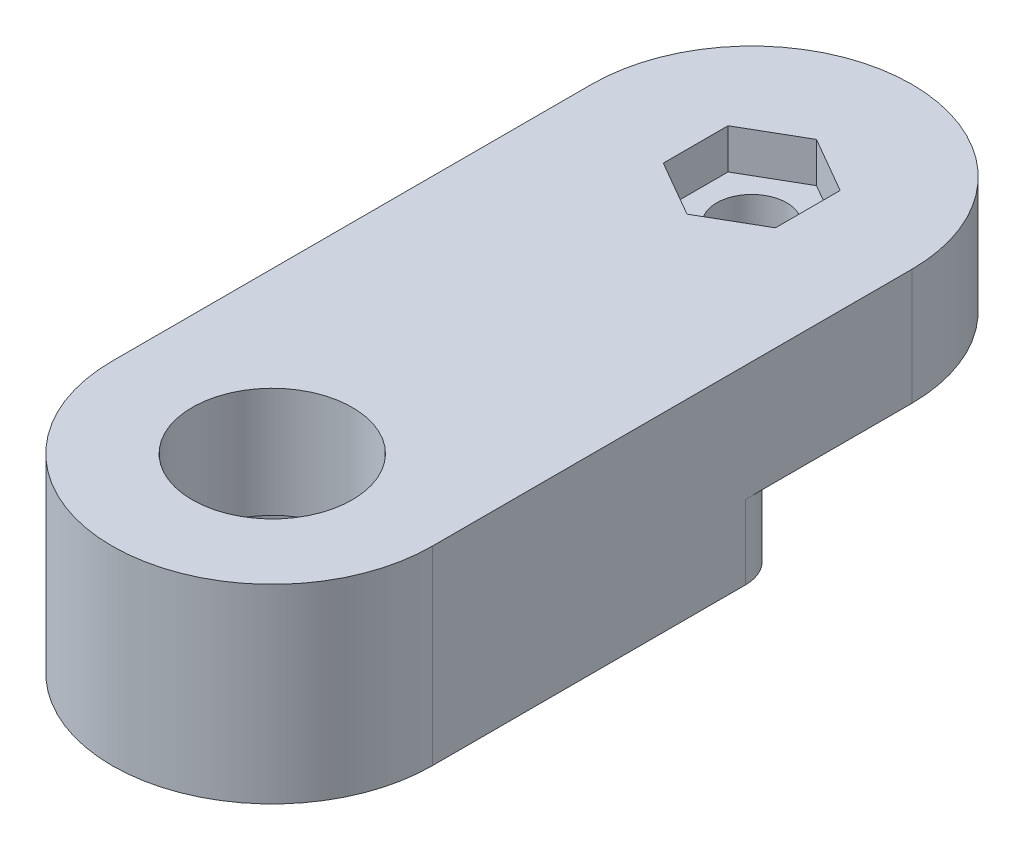
ISO-10303-21;
HEADER;
FILE_DESCRIPTION(('STEP AP214'),'2;1');
FILE_NAME('part.step','',(''),(''),'','','');
FILE_SCHEMA(('AUTOMOTIVE_DESIGN { 1 0 10303 214 1 1 1 1 }'));
ENDSEC;
DATA;
#1=APPLICATION_CONTEXT('core data for automotive mechanical design processes');
#2=APPLICATION_PROTOCOL_DEFINITION('international standard','automotive_design',2000,#1);
#3=PRODUCT_CONTEXT('',#1,'mechanical');
#4=PRODUCT('Part','Part','',(#3));
#5=PRODUCT_RELATED_PRODUCT_CATEGORY('part','',(#4));
#6=PRODUCT_DEFINITION_FORMATION('','',#4);
#7=PRODUCT_DEFINITION_CONTEXT('part definition',#1,'design');
#8=PRODUCT_DEFINITION('design','',#6,#7);
#9=PRODUCT_DEFINITION_SHAPE('','',#8);
#10=(LENGTH_UNIT() NAMED_UNIT(*) SI_UNIT(.MILLI.,.METRE.));
#11=(NAMED_UNIT(*) PLANE_ANGLE_UNIT() SI_UNIT($,.RADIAN.));
#12=(NAMED_UNIT(*) SI_UNIT($,.STERADIAN.) SOLID_ANGLE_UNIT());
#13=UNCERTAINTY_MEASURE_WITH_UNIT(LENGTH_MEASURE(1.E-05),#10,'distance_accuracy_value','');
#14=(GEOMETRIC_REPRESENTATION_CONTEXT(3) GLOBAL_UNCERTAINTY_ASSIGNED_CONTEXT((#13)) GLOBAL_UNIT_ASSIGNED_CONTEXT((#10,
#11,#12)) REPRESENTATION_CONTEXT('',''));
#15=CARTESIAN_POINT('',(0.,0.,0.));
#16=DIRECTION('',(0.,0.,1.));
#17=DIRECTION('',(1.,0.,0.));
#18=AXIS2_PLACEMENT_3D('',#15,#16,#17);
#19=CARTESIAN_POINT('',(0.,9.50100000000002,-23.95));
#20=DIRECTION('',(0.,-1.,0.));
#21=DIRECTION('',(0.,0.,-1.));
#22=AXIS2_PLACEMENT_3D('',#19,#20,#21);
#23=CYLINDRICAL_SURFACE('',#22,1.75);
#24=CARTESIAN_POINT('',(0.,3.5,-23.95));
#25=DIRECTION('',(0.,-1.,0.));
#26=DIRECTION('',(0.,0.,-1.));
#27=AXIS2_PLACEMENT_3D('',#24,#25,#26);
#28=CIRCLE('',#27,1.75);
#29=CARTESIAN_POINT('',(0.,3.5,-25.7));
#30=VERTEX_POINT('',#29);
#31=EDGE_CURVE('E196',#30,#30,#28,.T.);
#32=ORIENTED_EDGE('',*,*,#31,.T.);
#33=EDGE_LOOP('',(#32));
#34=FACE_BOUND('',#33,.T.);
#35=CARTESIAN_POINT('',(0.,7.5,-23.95));
#36=DIRECTION('',(0.,1.,0.));
#37=DIRECTION('',(0.,0.,1.));
#38=AXIS2_PLACEMENT_3D('',#35,#36,#37);
#39=CIRCLE('',#38,1.75);
#40=CARTESIAN_POINT('',(0.,7.5,-22.2));
#41=VERTEX_POINT('',#40);
#42=EDGE_CURVE('E188',#41,#41,#39,.F.);
#43=ORIENTED_EDGE('',*,*,#42,.F.);
#44=EDGE_LOOP('',(#43));
#45=FACE_BOUND('',#44,.T.);
#46=ADVANCED_FACE('F37',(#34,#45),#23,.F.);
#47=CARTESIAN_POINT('',(0.,3.7,0.));
#48=DIRECTION('',(0.,1.,0.));
#49=DIRECTION('',(0.,0.,1.));
#50=AXIS2_PLACEMENT_3D('',#47,#48,#49);
#51=PLANE('',#50);
#52=DIRECTION('',(0.,0.,-1.));
#53=VECTOR('',#52,1.);
#54=CARTESIAN_POINT('',(-8.,3.7,0.));
#55=LINE('',#54,#53);
#56=CARTESIAN_POINT('',(-8.,3.7,-15.6396149307027));
#57=VERTEX_POINT('',#56);
#58=CARTESIAN_POINT('',(-8.,3.7,-23.95));
#59=VERTEX_POINT('',#58);
#60=EDGE_CURVE('E205',#57,#59,#55,.T.);
#61=ORIENTED_EDGE('',*,*,#60,.T.);
#62=CARTESIAN_POINT('',(0.,3.7,-23.95));
#63=DIRECTION('',(0.,1.,0.));
#64=DIRECTION('',(0.,0.,1.));
#65=AXIS2_PLACEMENT_3D('',#62,#63,#64);
#66=CIRCLE('',#65,8.);
#67=CARTESIAN_POINT('',(8.,3.7,-23.95));
#68=VERTEX_POINT('',#67);
#69=EDGE_CURVE('E253',#68,#59,#66,.T.);
#70=ORIENTED_EDGE('',*,*,#69,.F.);
#71=DIRECTION('',(0.,0.,-1.));
#72=VECTOR('',#71,1.);
#73=CARTESIAN_POINT('',(8.,3.7,0.));
#74=LINE('',#73,#72);
#75=CARTESIAN_POINT('',(8.,3.7,-15.6396149307027));
#76=VERTEX_POINT('',#75);
#77=EDGE_CURVE('E51',#76,#68,#74,.T.);
#78=ORIENTED_EDGE('',*,*,#77,.F.);
#79=CARTESIAN_POINT('',(6.,3.7,-15.6396149307027));
#80=DIRECTION('',(0.,1.,0.));
#81=DIRECTION('',(0.,0.,1.));
#82=AXIS2_PLACEMENT_3D('',#79,#80,#81);
#83=CIRCLE('',#82,2.);
#84=CARTESIAN_POINT('',(4.82926829268293,3.7,-17.2611534808095));
#85=VERTEX_POINT('',#84);
#86=EDGE_CURVE('E12',#76,#85,#83,.T.);
#87=ORIENTED_EDGE('',*,*,#86,.T.);
#88=CARTESIAN_POINT('',(0.,3.7,-23.95));
#89=DIRECTION('',(0.,1.,0.));
#90=DIRECTION('',(0.,0.,1.));
#91=AXIS2_PLACEMENT_3D('',#88,#89,#90);
#92=CIRCLE('',#91,8.25);
#93=CARTESIAN_POINT('',(-4.82926829268293,3.7,-17.2611534808095));
#94=VERTEX_POINT('',#93);
#95=EDGE_CURVE('E202',#94,#85,#92,.T.);
#96=ORIENTED_EDGE('',*,*,#95,.F.);
#97=CARTESIAN_POINT('',(-6.,3.7,-15.6396149307027));
#98=DIRECTION('',(0.,1.,0.));
#99=DIRECTION('',(0.,0.,1.));
#100=AXIS2_PLACEMENT_3D('',#97,#98,#99);
#101=CIRCLE('',#100,2.);
#102=EDGE_CURVE('E45',#94,#57,#101,.T.);
#103=ORIENTED_EDGE('',*,*,#102,.T.);
#104=EDGE_LOOP('',(#61,#70,#78,#87,#96,#103));
#105=FACE_BOUND('',#104,.T.);
#106=CARTESIAN_POINT('',(0.,3.7,-23.95));
#107=DIRECTION('',(0.,1.,0.));
#108=DIRECTION('',(0.,0.,1.));
#109=AXIS2_PLACEMENT_3D('',#106,#107,#108);
#110=CIRCLE('',#109,4.1);
#111=CARTESIAN_POINT('',(0.,3.7,-19.85));
#112=VERTEX_POINT('',#111);
#113=EDGE_CURVE('E256',#112,#112,#110,.F.);
#114=ORIENTED_EDGE('',*,*,#113,.F.);
#115=EDGE_LOOP('',(#114));
#116=FACE_BOUND('',#115,.T.);
#117=ADVANCED_FACE('F277',(#105,#116),#51,.F.);
#118=CARTESIAN_POINT('',(-8.,4.,0.));
#119=DIRECTION('',(-1.,0.,0.));
#120=DIRECTION('',(0.,0.,1.));
#121=AXIS2_PLACEMENT_3D('',#118,#119,#120);
#122=PLANE('',#121);
#123=ORIENTED_EDGE('',*,*,#60,.F.);
#124=DIRECTION('',(0.,-1.,0.));
#125=VECTOR('',#124,1.);
#126=CARTESIAN_POINT('',(-8.,4.,-15.6396149307027));
#127=LINE('',#126,#125);
#128=CARTESIAN_POINT('',(-8.,0.,-15.6396149307027));
#129=VERTEX_POINT('',#128);
#130=EDGE_CURVE('E259',#57,#129,#127,.T.);
#131=ORIENTED_EDGE('',*,*,#130,.T.);
#132=DIRECTION('',(0.,0.,-1.));
#133=VECTOR('',#132,1.);
#134=CARTESIAN_POINT('',(-8.,0.,0.));
#135=LINE('',#134,#133);
#136=CARTESIAN_POINT('',(-8.,0.,0.));
#137=VERTEX_POINT('',#136);
#138=EDGE_CURVE('E228',#137,#129,#135,.T.);
#139=ORIENTED_EDGE('',*,*,#138,.F.);
#140=DIRECTION('',(0.,-1.,0.));
#141=VECTOR('',#140,1.);
#142=CARTESIAN_POINT('',(-8.,4.,0.));
#143=LINE('',#142,#141);
#144=CARTESIAN_POINT('',(-8.,9.50000000000002,0.));
#145=VERTEX_POINT('',#144);
#146=EDGE_CURVE('E248',#145,#137,#143,.T.);
#147=ORIENTED_EDGE('',*,*,#146,.F.);
#148=DIRECTION('',(0.,0.,1.));
#149=VECTOR('',#148,1.);
#150=CARTESIAN_POINT('',(-8.,9.5,-23.95));
#151=LINE('',#150,#149);
#152=CARTESIAN_POINT('',(-8.,9.50000000000002,-23.95));
#153=VERTEX_POINT('',#152);
#154=EDGE_CURVE('E214',#153,#145,#151,.T.);
#155=ORIENTED_EDGE('',*,*,#154,.F.);
#156=DIRECTION('',(0.,-1.,0.));
#157=VECTOR('',#156,1.);
#158=CARTESIAN_POINT('',(-8.,4.,-23.95));
#159=LINE('',#158,#157);
#160=EDGE_CURVE('E239',#153,#59,#159,.T.);
#161=ORIENTED_EDGE('',*,*,#160,.T.);
#162=EDGE_LOOP('',(#123,#131,#139,#147,#155,#161));
#163=FACE_BOUND('',#162,.T.);
#164=ADVANCED_FACE('F284',(#163),#122,.T.);
#165=CARTESIAN_POINT('',(8.,4.,0.));
#166=DIRECTION('',(-1.,0.,0.));
#167=DIRECTION('',(0.,0.,1.));
#168=AXIS2_PLACEMENT_3D('',#165,#166,#167);
#169=PLANE('',#168);
#170=DIRECTION('',(0.,0.,-1.));
#171=VECTOR('',#170,1.);
#172=CARTESIAN_POINT('',(8.,0.,0.));
#173=LINE('',#172,#171);
#174=CARTESIAN_POINT('',(8.,0.,0.));
#175=VERTEX_POINT('',#174);
#176=CARTESIAN_POINT('',(8.,0.,-15.6396149307027));
#177=VERTEX_POINT('',#176);
#178=EDGE_CURVE('E233',#175,#177,#173,.T.);
#179=ORIENTED_EDGE('',*,*,#178,.T.);
#180=DIRECTION('',(0.,1.,0.));
#181=VECTOR('',#180,1.);
#182=CARTESIAN_POINT('',(8.,3.7,-15.6396149307027));
#183=LINE('',#182,#181);
#184=EDGE_CURVE('E273',#177,#76,#183,.T.);
#185=ORIENTED_EDGE('',*,*,#184,.T.);
#186=ORIENTED_EDGE('',*,*,#77,.T.);
#187=DIRECTION('',(0.,-1.,0.));
#188=VECTOR('',#187,1.);
#189=CARTESIAN_POINT('',(8.,4.,-23.95));
#190=LINE('',#189,#188);
#191=CARTESIAN_POINT('',(8.,9.5,-23.95));
#192=VERTEX_POINT('',#191);
#193=EDGE_CURVE('E242',#192,#68,#190,.T.);
#194=ORIENTED_EDGE('',*,*,#193,.F.);
#195=DIRECTION('',(0.,0.,-1.));
#196=VECTOR('',#195,1.);
#197=CARTESIAN_POINT('',(8.,9.5,0.));
#198=LINE('',#197,#196);
#199=CARTESIAN_POINT('',(8.,9.50000000000002,0.));
#200=VERTEX_POINT('',#199);
#201=EDGE_CURVE('E208',#200,#192,#198,.T.);
#202=ORIENTED_EDGE('',*,*,#201,.F.);
#203=DIRECTION('',(0.,-1.,0.));
#204=VECTOR('',#203,1.);
#205=CARTESIAN_POINT('',(8.,4.,0.));
#206=LINE('',#205,#204);
#207=EDGE_CURVE('E245',#200,#175,#206,.T.);
#208=ORIENTED_EDGE('',*,*,#207,.T.);
#209=EDGE_LOOP('',(#179,#185,#186,#194,#202,#208));
#210=FACE_BOUND('',#209,.T.);
#211=ADVANCED_FACE('F296',(#210),#169,.F.);
#212=CARTESIAN_POINT('',(0.,4.,0.));
#213=DIRECTION('',(0.,-1.,0.));
#214=DIRECTION('',(0.,0.,-1.));
#215=AXIS2_PLACEMENT_3D('',#212,#213,#214);
#216=CYLINDRICAL_SURFACE('',#215,8.);
#217=CARTESIAN_POINT('',(0.,0.,0.));
#218=DIRECTION('',(0.,1.,0.));
#219=DIRECTION('',(0.,0.,1.));
#220=AXIS2_PLACEMENT_3D('',#217,#218,#219);
#221=CIRCLE('',#220,8.);
#222=EDGE_CURVE('E231',#137,#175,#221,.T.);
#223=ORIENTED_EDGE('',*,*,#222,.T.);
#224=ORIENTED_EDGE('',*,*,#207,.F.);
#225=CARTESIAN_POINT('',(0.,9.5,0.));
#226=DIRECTION('',(0.,1.,0.));
#227=DIRECTION('',(0.,0.,1.));
#228=AXIS2_PLACEMENT_3D('',#225,#226,#227);
#229=CIRCLE('',#228,8.);
#230=EDGE_CURVE('E211',#145,#200,#229,.T.);
#231=ORIENTED_EDGE('',*,*,#230,.F.);
#232=ORIENTED_EDGE('',*,*,#146,.T.);
#233=EDGE_LOOP('',(#223,#224,#231,#232));
#234=FACE_BOUND('',#233,.T.);
#235=ADVANCED_FACE('F292',(#234),#216,.T.);
#236=CARTESIAN_POINT('',(0.,4.,-23.95));
#237=DIRECTION('',(0.,-1.,0.));
#238=DIRECTION('',(0.,0.,-1.));
#239=AXIS2_PLACEMENT_3D('',#236,#237,#238);
#240=CYLINDRICAL_SURFACE('',#239,8.);
#241=ORIENTED_EDGE('',*,*,#193,.T.);
#242=ORIENTED_EDGE('',*,*,#69,.T.);
#243=ORIENTED_EDGE('',*,*,#160,.F.);
#244=CARTESIAN_POINT('',(0.,9.5,-23.95));
#245=DIRECTION('',(0.,1.,0.));
#246=DIRECTION('',(0.,0.,1.));
#247=AXIS2_PLACEMENT_3D('',#244,#245,#246);
#248=CIRCLE('',#247,8.);
#249=EDGE_CURVE('E217',#192,#153,#248,.T.);
#250=ORIENTED_EDGE('',*,*,#249,.F.);
#251=EDGE_LOOP('',(#241,#242,#243,#250));
#252=FACE_BOUND('',#251,.T.);
#253=ADVANCED_FACE('F303',(#252),#240,.T.);
#254=CARTESIAN_POINT('',(0.,4.,0.));
#255=DIRECTION('',(0.,-1.,0.));
#256=DIRECTION('',(0.,0.,-1.));
#257=AXIS2_PLACEMENT_3D('',#254,#255,#256);
#258=CYLINDRICAL_SURFACE('',#257,5.15);
#259=CARTESIAN_POINT('',(0.,4.,0.));
#260=DIRECTION('',(0.,1.,0.));
#261=DIRECTION('',(0.,0.,1.));
#262=AXIS2_PLACEMENT_3D('',#259,#260,#261);
#263=CIRCLE('',#262,5.15);
#264=CARTESIAN_POINT('',(0.,4.,5.15));
#265=VERTEX_POINT('',#264);
#266=EDGE_CURVE('E223',#265,#265,#263,.T.);
#267=ORIENTED_EDGE('',*,*,#266,.T.);
#268=EDGE_LOOP('',(#267));
#269=FACE_BOUND('',#268,.T.);
#270=CARTESIAN_POINT('',(0.,0.,0.));
#271=DIRECTION('',(0.,1.,0.));
#272=DIRECTION('',(0.,0.,1.));
#273=AXIS2_PLACEMENT_3D('',#270,#271,#272);
#274=CIRCLE('',#273,5.15);
#275=CARTESIAN_POINT('',(0.,0.,5.15));
#276=VERTEX_POINT('',#275);
#277=EDGE_CURVE('E236',#276,#276,#274,.T.);
#278=ORIENTED_EDGE('',*,*,#277,.F.);
#279=EDGE_LOOP('',(#278));
#280=FACE_BOUND('',#279,.T.);
#281=ADVANCED_FACE('F451',(#269,#280),#258,.F.);
#282=CARTESIAN_POINT('',(0.,0.,0.));
#283=DIRECTION('',(0.,1.,0.));
#284=DIRECTION('',(0.,0.,1.));
#285=AXIS2_PLACEMENT_3D('',#282,#283,#284);
#286=PLANE('',#285);
#287=ORIENTED_EDGE('',*,*,#138,.T.);
#288=CARTESIAN_POINT('',(-6.,0.,-15.6396149307027));
#289=DIRECTION('',(0.,1.,0.));
#290=DIRECTION('',(0.,0.,1.));
#291=AXIS2_PLACEMENT_3D('',#288,#289,#290);
#292=CIRCLE('',#291,2.);
#293=CARTESIAN_POINT('',(-4.82926829268293,0.,-17.2611534808095));
#294=VERTEX_POINT('',#293);
#295=EDGE_CURVE('E266',#129,#294,#292,.F.);
#296=ORIENTED_EDGE('',*,*,#295,.T.);
#297=CARTESIAN_POINT('',(0.,0.,-23.95));
#298=DIRECTION('',(0.,1.,0.));
#299=DIRECTION('',(0.,0.,1.));
#300=AXIS2_PLACEMENT_3D('',#297,#298,#299);
#301=CIRCLE('',#300,8.25);
#302=CARTESIAN_POINT('',(4.82926829268293,0.,-17.2611534808095));
#303=VERTEX_POINT('',#302);
#304=EDGE_CURVE('E250',#303,#294,#301,.F.);
#305=ORIENTED_EDGE('',*,*,#304,.F.);
#306=CARTESIAN_POINT('',(6.,0.,-15.6396149307027));
#307=DIRECTION('',(0.,1.,0.));
#308=DIRECTION('',(0.,0.,1.));
#309=AXIS2_PLACEMENT_3D('',#306,#307,#308);
#310=CIRCLE('',#309,2.);
#311=EDGE_CURVE('E264',#303,#177,#310,.F.);
#312=ORIENTED_EDGE('',*,*,#311,.T.);
#313=ORIENTED_EDGE('',*,*,#178,.F.);
#314=ORIENTED_EDGE('',*,*,#222,.F.);
#315=EDGE_LOOP('',(#287,#296,#305,#312,#313,#314));
#316=FACE_BOUND('',#315,.T.);
#317=ORIENTED_EDGE('',*,*,#277,.T.);
#318=EDGE_LOOP('',(#317));
#319=FACE_BOUND('',#318,.T.);
#320=ADVANCED_FACE('F287',(#316,#319),#286,.F.);
#321=CARTESIAN_POINT('',(0.,4.,-23.95));
#322=DIRECTION('',(0.,1.,0.));
#323=DIRECTION('',(0.,0.,1.));
#324=AXIS2_PLACEMENT_3D('',#321,#322,#323);
#325=PLANE('',#324);
#326=CARTESIAN_POINT('',(0.,4.,0.));
#327=DIRECTION('',(0.,1.,0.));
#328=DIRECTION('',(0.,0.,1.));
#329=AXIS2_PLACEMENT_3D('',#326,#327,#328);
#330=CIRCLE('',#329,4.);
#331=CARTESIAN_POINT('',(0.,4.,4.));
#332=VERTEX_POINT('',#331);
#333=EDGE_CURVE('E220',#332,#332,#330,.T.);
#334=ORIENTED_EDGE('',*,*,#333,.T.);
#335=EDGE_LOOP('',(#334));
#336=FACE_BOUND('',#335,.T.);
#337=ORIENTED_EDGE('',*,*,#266,.F.);
#338=EDGE_LOOP('',(#337));
#339=FACE_BOUND('',#338,.T.);
#340=ADVANCED_FACE('F435',(#336,#339),#325,.F.);
#341=CARTESIAN_POINT('',(0.,62.0348986289035,0.));
#342=DIRECTION('',(0.,-1.,0.));
#343=DIRECTION('',(0.,0.,-1.));
#344=AXIS2_PLACEMENT_3D('',#341,#342,#343);
#345=CYLINDRICAL_SURFACE('',#344,4.);
#346=ORIENTED_EDGE('',*,*,#333,.F.);
#347=EDGE_LOOP('',(#346));
#348=FACE_BOUND('',#347,.T.);
#349=CARTESIAN_POINT('',(0.,9.5,0.));
#350=DIRECTION('',(0.,1.,0.));
#351=DIRECTION('',(0.,0.,1.));
#352=AXIS2_PLACEMENT_3D('',#349,#350,#351);
#353=CIRCLE('',#352,4.);
#354=CARTESIAN_POINT('',(0.,9.5,4.));
#355=VERTEX_POINT('',#354);
#356=EDGE_CURVE('E207',#355,#355,#353,.T.);
#357=ORIENTED_EDGE('',*,*,#356,.T.);
#358=EDGE_LOOP('',(#357));
#359=FACE_BOUND('',#358,.T.);
#360=ADVANCED_FACE('F318',(#348,#359),#345,.F.);
#361=CARTESIAN_POINT('',(0.,9.5,0.));
#362=DIRECTION('',(0.,1.,0.));
#363=DIRECTION('',(0.,0.,1.));
#364=AXIS2_PLACEMENT_3D('',#361,#362,#363);
#365=PLANE('',#364);
#366=DIRECTION('',(0.866025403784439,0.,0.5));
#367=VECTOR('',#366,1.);
#368=CARTESIAN_POINT('',(-2.8,9.5,-22.333419246269));
#369=LINE('',#368,#367);
#370=CARTESIAN_POINT('',(-2.8,9.5,-22.333419246269));
#371=VERTEX_POINT('',#370);
#372=CARTESIAN_POINT('',(0.,9.5,-20.7168384925381));
#373=VERTEX_POINT('',#372);
#374=EDGE_CURVE('E143',#371,#373,#369,.T.);
#375=ORIENTED_EDGE('',*,*,#374,.F.);
#376=DIRECTION('',(0.,0.,1.));
#377=VECTOR('',#376,1.);
#378=CARTESIAN_POINT('',(-2.8,9.5,-25.5665807537309));
#379=LINE('',#378,#377);
#380=CARTESIAN_POINT('',(-2.8,9.5,-25.5665807537309));
#381=VERTEX_POINT('',#380);
#382=EDGE_CURVE('E162',#381,#371,#379,.T.);
#383=ORIENTED_EDGE('',*,*,#382,.F.);
#384=DIRECTION('',(-0.866025403784438,0.,0.5));
#385=VECTOR('',#384,1.);
#386=CARTESIAN_POINT('',(0.,9.5,-27.1831615074619));
#387=LINE('',#386,#385);
#388=CARTESIAN_POINT('',(0.,9.5,-27.1831615074619));
#389=VERTEX_POINT('',#388);
#390=EDGE_CURVE('E165',#389,#381,#387,.T.);
#391=ORIENTED_EDGE('',*,*,#390,.F.);
#392=DIRECTION('',(-0.866025403784439,0.,-0.5));
#393=VECTOR('',#392,1.);
#394=CARTESIAN_POINT('',(2.8,9.5,-25.5665807537309));
#395=LINE('',#394,#393);
#396=CARTESIAN_POINT('',(2.8,9.5,-25.5665807537309));
#397=VERTEX_POINT('',#396);
#398=EDGE_CURVE('E181',#397,#389,#395,.T.);
#399=ORIENTED_EDGE('',*,*,#398,.F.);
#400=DIRECTION('',(0.,0.,-1.));
#401=VECTOR('',#400,1.);
#402=CARTESIAN_POINT('',(2.8,9.5,-22.333419246269));
#403=LINE('',#402,#401);
#404=CARTESIAN_POINT('',(2.8,9.5,-22.333419246269));
#405=VERTEX_POINT('',#404);
#406=EDGE_CURVE('E178',#405,#397,#403,.T.);
#407=ORIENTED_EDGE('',*,*,#406,.F.);
#408=DIRECTION('',(0.866025403784438,0.,-0.5));
#409=VECTOR('',#408,1.);
#410=CARTESIAN_POINT('',(0.,9.5,-20.7168384925381));
#411=LINE('',#410,#409);
#412=EDGE_CURVE('E176',#373,#405,#411,.T.);
#413=ORIENTED_EDGE('',*,*,#412,.F.);
#414=EDGE_LOOP('',(#375,#383,#391,#399,#407,#413));
#415=FACE_BOUND('',#414,.T.);
#416=ORIENTED_EDGE('',*,*,#356,.F.);
#417=EDGE_LOOP('',(#416));
#418=FACE_BOUND('',#417,.T.);
#419=ORIENTED_EDGE('',*,*,#201,.T.);
#420=ORIENTED_EDGE('',*,*,#249,.T.);
#421=ORIENTED_EDGE('',*,*,#154,.T.);
#422=ORIENTED_EDGE('',*,*,#230,.T.);
#423=EDGE_LOOP('',(#419,#420,#421,#422));
#424=FACE_BOUND('',#423,.T.);
#425=ADVANCED_FACE('F300',(#415,#418,#424),#365,.T.);
#426=CARTESIAN_POINT('',(0.,32.8345237791561,-23.95));
#427=DIRECTION('',(0.,-1.,0.));
#428=DIRECTION('',(0.,0.,-1.));
#429=AXIS2_PLACEMENT_3D('',#426,#427,#428);
#430=CYLINDRICAL_SURFACE('',#429,8.25);
#431=ORIENTED_EDGE('',*,*,#304,.T.);
#432=DIRECTION('',(0.,-1.,0.));
#433=VECTOR('',#432,1.);
#434=CARTESIAN_POINT('',(-4.82926829268293,32.8345237791561,-17.2611534808095));
#435=LINE('',#434,#433);
#436=EDGE_CURVE('E271',#294,#94,#435,.F.);
#437=ORIENTED_EDGE('',*,*,#436,.T.);
#438=ORIENTED_EDGE('',*,*,#95,.T.);
#439=DIRECTION('',(0.,-1.,0.));
#440=VECTOR('',#439,1.);
#441=CARTESIAN_POINT('',(4.82926829268293,32.8345237791561,-17.2611534808095));
#442=LINE('',#441,#440);
#443=EDGE_CURVE('E268',#85,#303,#442,.T.);
#444=ORIENTED_EDGE('',*,*,#443,.T.);
#445=EDGE_LOOP('',(#431,#437,#438,#444));
#446=FACE_BOUND('',#445,.T.);
#447=ADVANCED_FACE('F307',(#446),#430,.F.);
#448=CARTESIAN_POINT('',(0.,3.5,-23.95));
#449=DIRECTION('',(0.,-1.,0.));
#450=DIRECTION('',(0.,0.,-1.));
#451=AXIS2_PLACEMENT_3D('',#448,#449,#450);
#452=PLANE('',#451);
#453=CARTESIAN_POINT('',(0.,3.5,-23.95));
#454=DIRECTION('',(0.,-1.,0.));
#455=DIRECTION('',(0.,0.,-1.));
#456=AXIS2_PLACEMENT_3D('',#453,#454,#455);
#457=CIRCLE('',#456,4.1);
#458=CARTESIAN_POINT('',(0.,3.5,-28.05));
#459=VERTEX_POINT('',#458);
#460=EDGE_CURVE('E199',#459,#459,#457,.T.);
#461=ORIENTED_EDGE('',*,*,#460,.T.);
#462=EDGE_LOOP('',(#461));
#463=FACE_BOUND('',#462,.T.);
#464=ORIENTED_EDGE('',*,*,#31,.F.);
#465=EDGE_LOOP('',(#464));
#466=FACE_BOUND('',#465,.T.);
#467=ADVANCED_FACE('F309',(#463,#466),#452,.T.);
#468=CARTESIAN_POINT('',(0.,3.5,-23.95));
#469=DIRECTION('',(0.,1.,0.));
#470=DIRECTION('',(0.,0.,1.));
#471=AXIS2_PLACEMENT_3D('',#468,#469,#470);
#472=CYLINDRICAL_SURFACE('',#471,4.1);
#473=ORIENTED_EDGE('',*,*,#460,.F.);
#474=EDGE_LOOP('',(#473));
#475=FACE_BOUND('',#474,.T.);
#476=ORIENTED_EDGE('',*,*,#113,.T.);
#477=EDGE_LOOP('',(#476));
#478=FACE_BOUND('',#477,.T.);
#479=ADVANCED_FACE('F315',(#475,#478),#472,.T.);
#480=CARTESIAN_POINT('',(0.,7.5,0.));
#481=DIRECTION('',(0.,1.,0.));
#482=DIRECTION('',(0.,0.,1.));
#483=AXIS2_PLACEMENT_3D('',#480,#481,#482);
#484=PLANE('',#483);
#485=DIRECTION('',(0.866025403784439,0.,0.5));
#486=VECTOR('',#485,1.);
#487=CARTESIAN_POINT('',(-2.8,7.5,-22.333419246269));
#488=LINE('',#487,#486);
#489=CARTESIAN_POINT('',(-2.8,7.5,-22.333419246269));
#490=VERTEX_POINT('',#489);
#491=CARTESIAN_POINT('',(0.,7.5,-20.7168384925381));
#492=VERTEX_POINT('',#491);
#493=EDGE_CURVE('E140',#490,#492,#488,.T.);
#494=ORIENTED_EDGE('',*,*,#493,.T.);
#495=DIRECTION('',(0.866025403784438,0.,-0.5));
#496=VECTOR('',#495,1.);
#497=CARTESIAN_POINT('',(0.,7.5,-20.7168384925381));
#498=LINE('',#497,#496);
#499=CARTESIAN_POINT('',(2.8,7.5,-22.333419246269));
#500=VERTEX_POINT('',#499);
#501=EDGE_CURVE('E151',#492,#500,#498,.T.);
#502=ORIENTED_EDGE('',*,*,#501,.T.);
#503=DIRECTION('',(0.,0.,-1.));
#504=VECTOR('',#503,1.);
#505=CARTESIAN_POINT('',(2.8,7.5,-22.333419246269));
#506=LINE('',#505,#504);
#507=CARTESIAN_POINT('',(2.8,7.5,-25.5665807537309));
#508=VERTEX_POINT('',#507);
#509=EDGE_CURVE('E156',#500,#508,#506,.T.);
#510=ORIENTED_EDGE('',*,*,#509,.T.);
#511=DIRECTION('',(-0.866025403784439,0.,-0.5));
#512=VECTOR('',#511,1.);
#513=CARTESIAN_POINT('',(2.8,7.5,-25.5665807537309));
#514=LINE('',#513,#512);
#515=CARTESIAN_POINT('',(0.,7.5,-27.1831615074619));
#516=VERTEX_POINT('',#515);
#517=EDGE_CURVE('E169',#508,#516,#514,.T.);
#518=ORIENTED_EDGE('',*,*,#517,.T.);
#519=DIRECTION('',(-0.866025403784438,0.,0.5));
#520=VECTOR('',#519,1.);
#521=CARTESIAN_POINT('',(0.,7.5,-27.1831615074619));
#522=LINE('',#521,#520);
#523=CARTESIAN_POINT('',(-2.8,7.5,-25.5665807537309));
#524=VERTEX_POINT('',#523);
#525=EDGE_CURVE('E172',#516,#524,#522,.T.);
#526=ORIENTED_EDGE('',*,*,#525,.T.);
#527=DIRECTION('',(0.,0.,1.));
#528=VECTOR('',#527,1.);
#529=CARTESIAN_POINT('',(-2.8,7.5,-25.5665807537309));
#530=LINE('',#529,#528);
#531=EDGE_CURVE('E148',#524,#490,#530,.T.);
#532=ORIENTED_EDGE('',*,*,#531,.T.);
#533=EDGE_LOOP('',(#494,#502,#510,#518,#526,#532));
#534=FACE_BOUND('',#533,.T.);
#535=ORIENTED_EDGE('',*,*,#42,.T.);
#536=EDGE_LOOP('',(#535));
#537=FACE_BOUND('',#536,.T.);
#538=ADVANCED_FACE('F158',(#534,#537),#484,.T.);
#539=CARTESIAN_POINT('',(-2.8,7.5,-22.333419246269));
#540=DIRECTION('',(-0.5,0.,0.866025403784439));
#541=DIRECTION('',(0.866025403784439,0.,0.5));
#542=AXIS2_PLACEMENT_3D('',#539,#540,#541);
#543=PLANE('',#542);
#544=ORIENTED_EDGE('',*,*,#374,.T.);
#545=DIRECTION('',(0.,1.,0.));
#546=VECTOR('',#545,1.);
#547=CARTESIAN_POINT('',(0.,7.5,-20.7168384925381));
#548=LINE('',#547,#546);
#549=EDGE_CURVE('E136',#492,#373,#548,.T.);
#550=ORIENTED_EDGE('',*,*,#549,.F.);
#551=ORIENTED_EDGE('',*,*,#493,.F.);
#552=DIRECTION('',(0.,1.,0.));
#553=VECTOR('',#552,1.);
#554=CARTESIAN_POINT('',(-2.8,7.5,-22.333419246269));
#555=LINE('',#554,#553);
#556=EDGE_CURVE('E186',#490,#371,#555,.T.);
#557=ORIENTED_EDGE('',*,*,#556,.T.);
#558=EDGE_LOOP('',(#544,#550,#551,#557));
#559=FACE_BOUND('',#558,.T.);
#560=ADVANCED_FACE('F138',(#559),#543,.F.);
#561=CARTESIAN_POINT('',(-2.8,7.5,-25.5665807537309));
#562=DIRECTION('',(-1.,0.,0.));
#563=DIRECTION('',(0.,0.,1.));
#564=AXIS2_PLACEMENT_3D('',#561,#562,#563);
#565=PLANE('',#564);
#566=ORIENTED_EDGE('',*,*,#382,.T.);
#567=ORIENTED_EDGE('',*,*,#556,.F.);
#568=ORIENTED_EDGE('',*,*,#531,.F.);
#569=DIRECTION('',(0.,1.,0.));
#570=VECTOR('',#569,1.);
#571=CARTESIAN_POINT('',(-2.8,7.5,-25.5665807537309));
#572=LINE('',#571,#570);
#573=EDGE_CURVE('E189',#524,#381,#572,.T.);
#574=ORIENTED_EDGE('',*,*,#573,.T.);
#575=EDGE_LOOP('',(#566,#567,#568,#574));
#576=FACE_BOUND('',#575,.T.);
#577=ADVANCED_FACE('F335',(#576),#565,.F.);
#578=CARTESIAN_POINT('',(0.,7.5,-27.1831615074619));
#579=DIRECTION('',(-0.5,0.,-0.866025403784439));
#580=DIRECTION('',(-0.866025403784439,0.,0.5));
#581=AXIS2_PLACEMENT_3D('',#578,#579,#580);
#582=PLANE('',#581);
#583=ORIENTED_EDGE('',*,*,#390,.T.);
#584=ORIENTED_EDGE('',*,*,#573,.F.);
#585=ORIENTED_EDGE('',*,*,#525,.F.);
#586=DIRECTION('',(0.,1.,0.));
#587=VECTOR('',#586,1.);
#588=CARTESIAN_POINT('',(0.,7.5,-27.1831615074619));
#589=LINE('',#588,#587);
#590=EDGE_CURVE('E191',#516,#389,#589,.T.);
#591=ORIENTED_EDGE('',*,*,#590,.T.);
#592=EDGE_LOOP('',(#583,#584,#585,#591));
#593=FACE_BOUND('',#592,.T.);
#594=ADVANCED_FACE('F345',(#593),#582,.F.);
#595=CARTESIAN_POINT('',(2.8,7.5,-25.5665807537309));
#596=DIRECTION('',(0.5,0.,-0.866025403784439));
#597=DIRECTION('',(-0.866025403784439,0.,-0.5));
#598=AXIS2_PLACEMENT_3D('',#595,#596,#597);
#599=PLANE('',#598);
#600=ORIENTED_EDGE('',*,*,#398,.T.);
#601=ORIENTED_EDGE('',*,*,#590,.F.);
#602=ORIENTED_EDGE('',*,*,#517,.F.);
#603=DIRECTION('',(0.,1.,0.));
#604=VECTOR('',#603,1.);
#605=CARTESIAN_POINT('',(2.8,7.5,-25.5665807537309));
#606=LINE('',#605,#604);
#607=EDGE_CURVE('E193',#508,#397,#606,.T.);
#608=ORIENTED_EDGE('',*,*,#607,.T.);
#609=EDGE_LOOP('',(#600,#601,#602,#608));
#610=FACE_BOUND('',#609,.T.);
#611=ADVANCED_FACE('F341',(#610),#599,.F.);
#612=CARTESIAN_POINT('',(2.8,7.5,-22.333419246269));
#613=DIRECTION('',(1.,0.,0.));
#614=DIRECTION('',(0.,0.,-1.));
#615=AXIS2_PLACEMENT_3D('',#612,#613,#614);
#616=PLANE('',#615);
#617=ORIENTED_EDGE('',*,*,#406,.T.);
#618=ORIENTED_EDGE('',*,*,#607,.F.);
#619=ORIENTED_EDGE('',*,*,#509,.F.);
#620=DIRECTION('',(0.,1.,0.));
#621=VECTOR('',#620,1.);
#622=CARTESIAN_POINT('',(2.8,7.5,-22.333419246269));
#623=LINE('',#622,#621);
#624=EDGE_CURVE('E147',#500,#405,#623,.T.);
#625=ORIENTED_EDGE('',*,*,#624,.T.);
#626=EDGE_LOOP('',(#617,#618,#619,#625));
#627=FACE_BOUND('',#626,.T.);
#628=ADVANCED_FACE('F338',(#627),#616,.F.);
#629=CARTESIAN_POINT('',(0.,7.5,-20.7168384925381));
#630=DIRECTION('',(0.5,0.,0.866025403784439));
#631=DIRECTION('',(0.866025403784438,0.,-0.5));
#632=AXIS2_PLACEMENT_3D('',#629,#630,#631);
#633=PLANE('',#632);
#634=ORIENTED_EDGE('',*,*,#412,.T.);
#635=ORIENTED_EDGE('',*,*,#624,.F.);
#636=ORIENTED_EDGE('',*,*,#501,.F.);
#637=ORIENTED_EDGE('',*,*,#549,.T.);
#638=EDGE_LOOP('',(#634,#635,#636,#637));
#639=FACE_BOUND('',#638,.T.);
#640=ADVANCED_FACE('F152',(#639),#633,.F.);
#641=CARTESIAN_POINT('',(-6.,32.8345237791561,-15.6396149307027));
#642=DIRECTION('',(0.,-1.,0.));
#643=DIRECTION('',(0.,0.,-1.));
#644=AXIS2_PLACEMENT_3D('',#641,#642,#643);
#645=CYLINDRICAL_SURFACE('',#644,2.);
#646=ORIENTED_EDGE('',*,*,#102,.F.);
#647=ORIENTED_EDGE('',*,*,#436,.F.);
#648=ORIENTED_EDGE('',*,*,#295,.F.);
#649=ORIENTED_EDGE('',*,*,#130,.F.);
#650=EDGE_LOOP('',(#646,#647,#648,#649));
#651=FACE_BOUND('',#650,.T.);
#652=ADVANCED_FACE('F281',(#651),#645,.T.);
#653=CARTESIAN_POINT('',(6.,32.8345237791561,-15.6396149307027));
#654=DIRECTION('',(0.,-1.,0.));
#655=DIRECTION('',(0.,0.,-1.));
#656=AXIS2_PLACEMENT_3D('',#653,#654,#655);
#657=CYLINDRICAL_SURFACE('',#656,2.);
#658=ORIENTED_EDGE('',*,*,#86,.F.);
#659=ORIENTED_EDGE('',*,*,#184,.F.);
#660=ORIENTED_EDGE('',*,*,#311,.F.);
#661=ORIENTED_EDGE('',*,*,#443,.F.);
#662=EDGE_LOOP('',(#658,#659,#660,#661));
#663=FACE_BOUND('',#662,.T.);
#664=ADVANCED_FACE('F39',(#663),#657,.T.);
#665=CLOSED_SHELL('',(#46,#117,#164,#211,#235,#253,#281,#320,#340,#360,#425,#447,#467,#479,#538,
#560,#577,#594,#611,#628,#640,#652,#664));
#666=MANIFOLD_SOLID_BREP('B2',#665);
#667=ADVANCED_BREP_SHAPE_REPRESENTATION('',(#18,#666),#14);
#668=SHAPE_DEFINITION_REPRESENTATION(#9,#667);
ENDSEC;
END-ISO-10303-21;
